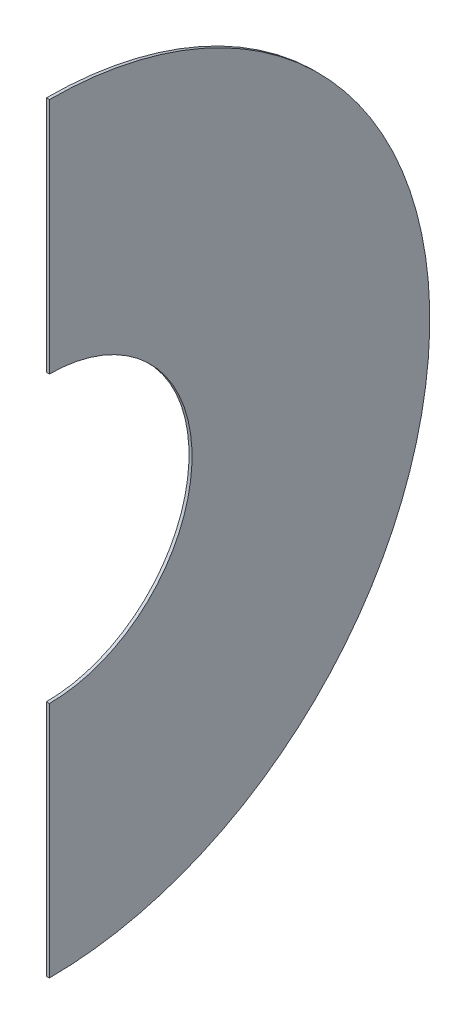
ISO-10303-21;
HEADER;
FILE_DESCRIPTION(('STEP AP214'),'2;1');
FILE_NAME('part.step','',(''),(''),'','','');
FILE_SCHEMA(('AUTOMOTIVE_DESIGN { 1 0 10303 214 1 1 1 1 }'));
ENDSEC;
DATA;
#1=APPLICATION_CONTEXT('core data for automotive mechanical design processes');
#2=APPLICATION_PROTOCOL_DEFINITION('international standard','automotive_design',2000,#1);
#3=PRODUCT_CONTEXT('',#1,'mechanical');
#4=PRODUCT('Part','Part','',(#3));
#5=PRODUCT_RELATED_PRODUCT_CATEGORY('part','',(#4));
#6=PRODUCT_DEFINITION_FORMATION('','',#4);
#7=PRODUCT_DEFINITION_CONTEXT('part definition',#1,'design');
#8=PRODUCT_DEFINITION('design','',#6,#7);
#9=PRODUCT_DEFINITION_SHAPE('','',#8);
#10=(LENGTH_UNIT() NAMED_UNIT(*) SI_UNIT(.MILLI.,.METRE.));
#11=(NAMED_UNIT(*) PLANE_ANGLE_UNIT() SI_UNIT($,.RADIAN.));
#12=(NAMED_UNIT(*) SI_UNIT($,.STERADIAN.) SOLID_ANGLE_UNIT());
#13=UNCERTAINTY_MEASURE_WITH_UNIT(LENGTH_MEASURE(1.E-05),#10,'distance_accuracy_value','');
#14=(GEOMETRIC_REPRESENTATION_CONTEXT(3) GLOBAL_UNCERTAINTY_ASSIGNED_CONTEXT((#13)) GLOBAL_UNIT_ASSIGNED_CONTEXT((#10,
#11,#12)) REPRESENTATION_CONTEXT('',''));
#15=CARTESIAN_POINT('',(0.,0.,0.));
#16=DIRECTION('',(0.,0.,1.));
#17=DIRECTION('',(1.,0.,0.));
#18=AXIS2_PLACEMENT_3D('',#15,#16,#17);
#19=CARTESIAN_POINT('',(1.5875,0.,0.));
#20=DIRECTION('',(-1.,0.,0.));
#21=DIRECTION('',(0.,0.,1.));
#22=AXIS2_PLACEMENT_3D('',#19,#20,#21);
#23=CYLINDRICAL_SURFACE('',#22,75.);
#24=CARTESIAN_POINT('',(0.,0.,0.));
#25=DIRECTION('',(1.,0.,0.));
#26=DIRECTION('',(0.,0.,-1.));
#27=AXIS2_PLACEMENT_3D('',#24,#25,#26);
#28=CIRCLE('',#27,75.);
#29=CARTESIAN_POINT('',(0.,-75.,0.));
#30=VERTEX_POINT('',#29);
#31=CARTESIAN_POINT('',(0.,75.,0.));
#32=VERTEX_POINT('',#31);
#33=EDGE_CURVE('E92',#30,#32,#28,.T.);
#34=ORIENTED_EDGE('',*,*,#33,.F.);
#35=DIRECTION('',(-1.,0.,0.));
#36=VECTOR('',#35,1.);
#37=CARTESIAN_POINT('',(1.5875,-75.,0.));
#38=LINE('',#37,#36);
#39=CARTESIAN_POINT('',(1.5875,-75.,0.));
#40=VERTEX_POINT('',#39);
#41=EDGE_CURVE('E11',#40,#30,#38,.T.);
#42=ORIENTED_EDGE('',*,*,#41,.F.);
#43=CARTESIAN_POINT('',(1.5875,0.,0.));
#44=DIRECTION('',(1.,0.,0.));
#45=DIRECTION('',(0.,0.,-1.));
#46=AXIS2_PLACEMENT_3D('',#43,#44,#45);
#47=CIRCLE('',#46,75.);
#48=CARTESIAN_POINT('',(1.5875,75.,0.));
#49=VERTEX_POINT('',#48);
#50=EDGE_CURVE('E81',#40,#49,#47,.T.);
#51=ORIENTED_EDGE('',*,*,#50,.T.);
#52=DIRECTION('',(-1.,0.,0.));
#53=VECTOR('',#52,1.);
#54=CARTESIAN_POINT('',(1.5875,75.,0.));
#55=LINE('',#54,#53);
#56=EDGE_CURVE('E70',#49,#32,#55,.T.);
#57=ORIENTED_EDGE('',*,*,#56,.T.);
#58=EDGE_LOOP('',(#34,#42,#51,#57));
#59=FACE_BOUND('',#58,.T.);
#60=ADVANCED_FACE('F31',(#59),#23,.F.);
#61=CARTESIAN_POINT('',(1.5875,0.,0.));
#62=DIRECTION('',(0.,0.,-1.));
#63=DIRECTION('',(-1.,0.,0.));
#64=AXIS2_PLACEMENT_3D('',#61,#62,#63);
#65=PLANE('',#64);
#66=DIRECTION('',(0.,-1.,0.));
#67=VECTOR('',#66,1.);
#68=CARTESIAN_POINT('',(0.,0.,0.));
#69=LINE('',#68,#67);
#70=CARTESIAN_POINT('',(0.,-200.,0.));
#71=VERTEX_POINT('',#70);
#72=EDGE_CURVE('E86',#30,#71,#69,.T.);
#73=ORIENTED_EDGE('',*,*,#72,.T.);
#74=DIRECTION('',(-1.,0.,0.));
#75=VECTOR('',#74,1.);
#76=CARTESIAN_POINT('',(1.5875,-200.,0.));
#77=LINE('',#76,#75);
#78=CARTESIAN_POINT('',(1.5875,-200.,0.));
#79=VERTEX_POINT('',#78);
#80=EDGE_CURVE('E39',#79,#71,#77,.T.);
#81=ORIENTED_EDGE('',*,*,#80,.F.);
#82=DIRECTION('',(0.,-1.,0.));
#83=VECTOR('',#82,1.);
#84=CARTESIAN_POINT('',(1.5875,0.,0.));
#85=LINE('',#84,#83);
#86=EDGE_CURVE('E76',#40,#79,#85,.T.);
#87=ORIENTED_EDGE('',*,*,#86,.F.);
#88=ORIENTED_EDGE('',*,*,#41,.T.);
#89=EDGE_LOOP('',(#73,#81,#87,#88));
#90=FACE_BOUND('',#89,.T.);
#91=ADVANCED_FACE('F84',(#90),#65,.F.);
#92=CARTESIAN_POINT('',(1.5875,0.,0.));
#93=DIRECTION('',(-1.,0.,0.));
#94=DIRECTION('',(0.,0.,1.));
#95=AXIS2_PLACEMENT_3D('',#92,#93,#94);
#96=CYLINDRICAL_SURFACE('',#95,200.);
#97=CARTESIAN_POINT('',(0.,0.,0.));
#98=DIRECTION('',(1.,0.,0.));
#99=DIRECTION('',(0.,0.,-1.));
#100=AXIS2_PLACEMENT_3D('',#97,#98,#99);
#101=CIRCLE('',#100,200.);
#102=CARTESIAN_POINT('',(0.,200.,0.));
#103=VERTEX_POINT('',#102);
#104=EDGE_CURVE('E63',#71,#103,#101,.T.);
#105=ORIENTED_EDGE('',*,*,#104,.T.);
#106=DIRECTION('',(-1.,0.,0.));
#107=VECTOR('',#106,1.);
#108=CARTESIAN_POINT('',(1.5875,200.,0.));
#109=LINE('',#108,#107);
#110=CARTESIAN_POINT('',(1.5875,200.,0.));
#111=VERTEX_POINT('',#110);
#112=EDGE_CURVE('E87',#111,#103,#109,.T.);
#113=ORIENTED_EDGE('',*,*,#112,.F.);
#114=CARTESIAN_POINT('',(1.5875,0.,0.));
#115=DIRECTION('',(1.,0.,0.));
#116=DIRECTION('',(0.,0.,-1.));
#117=AXIS2_PLACEMENT_3D('',#114,#115,#116);
#118=CIRCLE('',#117,200.);
#119=EDGE_CURVE('E80',#79,#111,#118,.T.);
#120=ORIENTED_EDGE('',*,*,#119,.F.);
#121=ORIENTED_EDGE('',*,*,#80,.T.);
#122=EDGE_LOOP('',(#105,#113,#120,#121));
#123=FACE_BOUND('',#122,.T.);
#124=ADVANCED_FACE('F88',(#123),#96,.T.);
#125=EDGE_CURVE('E96',#103,#32,#69,.T.);
#126=ORIENTED_EDGE('',*,*,#125,.T.);
#127=ORIENTED_EDGE('',*,*,#56,.F.);
#128=EDGE_CURVE('E47',#111,#49,#85,.T.);
#129=ORIENTED_EDGE('',*,*,#128,.F.);
#130=ORIENTED_EDGE('',*,*,#112,.T.);
#131=EDGE_LOOP('',(#126,#127,#129,#130));
#132=FACE_BOUND('',#131,.T.);
#133=ADVANCED_FACE('F101',(#132),#65,.F.);
#134=CARTESIAN_POINT('',(1.5875,0.,-440.141421356237));
#135=DIRECTION('',(1.,0.,0.));
#136=DIRECTION('',(0.,0.,-1.));
#137=AXIS2_PLACEMENT_3D('',#134,#135,#136);
#138=PLANE('',#137);
#139=ORIENTED_EDGE('',*,*,#50,.F.);
#140=ORIENTED_EDGE('',*,*,#86,.T.);
#141=ORIENTED_EDGE('',*,*,#119,.T.);
#142=ORIENTED_EDGE('',*,*,#128,.T.);
#143=EDGE_LOOP('',(#139,#140,#141,#142));
#144=FACE_BOUND('',#143,.T.);
#145=ADVANCED_FACE('F78',(#144),#138,.T.);
#146=CARTESIAN_POINT('',(0.,0.,-440.141421356237));
#147=DIRECTION('',(1.,0.,0.));
#148=DIRECTION('',(0.,0.,-1.));
#149=AXIS2_PLACEMENT_3D('',#146,#147,#148);
#150=PLANE('',#149);
#151=ORIENTED_EDGE('',*,*,#33,.T.);
#152=ORIENTED_EDGE('',*,*,#125,.F.);
#153=ORIENTED_EDGE('',*,*,#104,.F.);
#154=ORIENTED_EDGE('',*,*,#72,.F.);
#155=EDGE_LOOP('',(#151,#152,#153,#154));
#156=FACE_BOUND('',#155,.T.);
#157=ADVANCED_FACE('F103',(#156),#150,.F.);
#158=CLOSED_SHELL('',(#60,#91,#124,#133,#145,#157));
#159=MANIFOLD_SOLID_BREP('B2',#158);
#160=ADVANCED_BREP_SHAPE_REPRESENTATION('',(#18,#159),#14);
#161=SHAPE_DEFINITION_REPRESENTATION(#9,#160);
ENDSEC;
END-ISO-10303-21;
